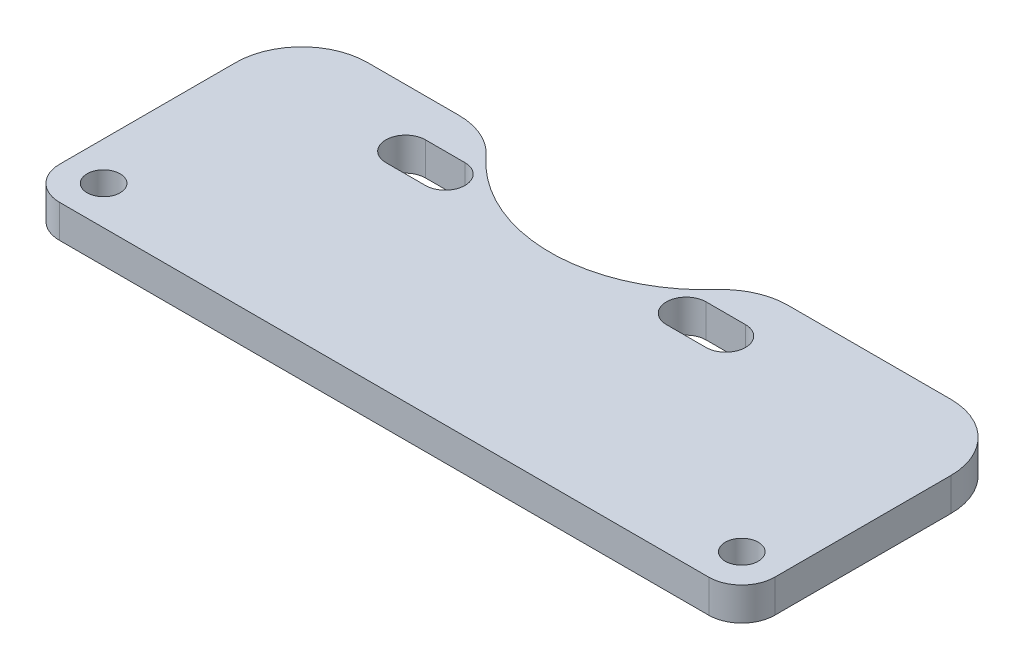
ISO-10303-21;
HEADER;
FILE_DESCRIPTION(('STEP AP214'),'2;1');
FILE_NAME('part.step','',(''),(''),'','','');
FILE_SCHEMA(('AUTOMOTIVE_DESIGN { 1 0 10303 214 1 1 1 1 }'));
ENDSEC;
DATA;
#1=APPLICATION_CONTEXT('core data for automotive mechanical design processes');
#2=APPLICATION_PROTOCOL_DEFINITION('international standard','automotive_design',2000,#1);
#3=PRODUCT_CONTEXT('',#1,'mechanical');
#4=PRODUCT('Part','Part','',(#3));
#5=PRODUCT_RELATED_PRODUCT_CATEGORY('part','',(#4));
#6=PRODUCT_DEFINITION_FORMATION('','',#4);
#7=PRODUCT_DEFINITION_CONTEXT('part definition',#1,'design');
#8=PRODUCT_DEFINITION('design','',#6,#7);
#9=PRODUCT_DEFINITION_SHAPE('','',#8);
#10=(LENGTH_UNIT() NAMED_UNIT(*) SI_UNIT(.MILLI.,.METRE.));
#11=(NAMED_UNIT(*) PLANE_ANGLE_UNIT() SI_UNIT($,.RADIAN.));
#12=(NAMED_UNIT(*) SI_UNIT($,.STERADIAN.) SOLID_ANGLE_UNIT());
#13=UNCERTAINTY_MEASURE_WITH_UNIT(LENGTH_MEASURE(1.E-05),#10,'distance_accuracy_value','');
#14=(GEOMETRIC_REPRESENTATION_CONTEXT(3) GLOBAL_UNCERTAINTY_ASSIGNED_CONTEXT((#13)) GLOBAL_UNIT_ASSIGNED_CONTEXT((#10,
#11,#12)) REPRESENTATION_CONTEXT('',''));
#15=CARTESIAN_POINT('',(0.,0.,0.));
#16=DIRECTION('',(0.,0.,1.));
#17=DIRECTION('',(1.,0.,0.));
#18=AXIS2_PLACEMENT_3D('',#15,#16,#17);
#19=CARTESIAN_POINT('',(-13.25,3.,-4.49999999999999));
#20=DIRECTION('',(0.,-1.,0.));
#21=DIRECTION('',(0.,0.,-1.));
#22=AXIS2_PLACEMENT_3D('',#19,#20,#21);
#23=CYLINDRICAL_SURFACE('',#22,14.15);
#24=CARTESIAN_POINT('',(-13.25,0.,-4.49999999999999));
#25=DIRECTION('',(0.,1.,0.));
#26=DIRECTION('',(0.,0.,1.));
#27=AXIS2_PLACEMENT_3D('',#24,#25,#26);
#28=CIRCLE('',#27,14.15);
#29=CARTESIAN_POINT('',(-23.7547264195242,0.,4.9801488833747));
#30=VERTEX_POINT('',#29);
#31=CARTESIAN_POINT('',(-2.7452735804758,0.,4.9801488833747));
#32=VERTEX_POINT('',#31);
#33=EDGE_CURVE('E260',#30,#32,#28,.T.);
#34=ORIENTED_EDGE('',*,*,#33,.F.);
#35=DIRECTION('',(0.,-1.,0.));
#36=VECTOR('',#35,1.);
#37=CARTESIAN_POINT('',(-23.7547264195242,3.,4.98014888337469));
#38=LINE('',#37,#36);
#39=CARTESIAN_POINT('',(-23.7547264195242,3.,4.9801488833747));
#40=VERTEX_POINT('',#39);
#41=EDGE_CURVE('E326',#30,#40,#38,.F.);
#42=ORIENTED_EDGE('',*,*,#41,.T.);
#43=CARTESIAN_POINT('',(-13.25,3.,-4.49999999999999));
#44=DIRECTION('',(0.,1.,0.));
#45=DIRECTION('',(0.,0.,1.));
#46=AXIS2_PLACEMENT_3D('',#43,#44,#45);
#47=CIRCLE('',#46,14.15);
#48=CARTESIAN_POINT('',(-2.7452735804758,3.,4.9801488833747));
#49=VERTEX_POINT('',#48);
#50=EDGE_CURVE('E219',#40,#49,#47,.T.);
#51=ORIENTED_EDGE('',*,*,#50,.T.);
#52=DIRECTION('',(0.,-1.,0.));
#53=VECTOR('',#52,1.);
#54=CARTESIAN_POINT('',(-2.7452735804758,3.,4.9801488833747));
#55=LINE('',#54,#53);
#56=EDGE_CURVE('E323',#49,#32,#55,.T.);
#57=ORIENTED_EDGE('',*,*,#56,.T.);
#58=EDGE_LOOP('',(#34,#42,#51,#57));
#59=FACE_BOUND('',#58,.T.);
#60=ADVANCED_FACE('F37',(#59),#23,.F.);
#61=CARTESIAN_POINT('',(0.,3.,3.00000000000001));
#62=DIRECTION('',(0.,0.,-1.));
#63=DIRECTION('',(-1.,0.,0.));
#64=AXIS2_PLACEMENT_3D('',#61,#62,#63);
#65=PLANE('',#64);
#66=DIRECTION('',(1.,0.,0.));
#67=VECTOR('',#66,1.);
#68=CARTESIAN_POINT('',(0.,3.,3.00000000000001));
#69=LINE('',#68,#67);
#70=CARTESIAN_POINT('',(-36.5,3.,3.00000000000001));
#71=VERTEX_POINT('',#70);
#72=CARTESIAN_POINT('',(-28.2090273747995,3.,3.00000000000001));
#73=VERTEX_POINT('',#72);
#74=EDGE_CURVE('E222',#71,#73,#69,.T.);
#75=ORIENTED_EDGE('',*,*,#74,.T.);
#76=DIRECTION('',(0.,-1.,0.));
#77=VECTOR('',#76,1.);
#78=CARTESIAN_POINT('',(-28.2090273747995,3.,3.00000000000001));
#79=LINE('',#78,#77);
#80=CARTESIAN_POINT('',(-28.2090273747995,0.,3.00000000000001));
#81=VERTEX_POINT('',#80);
#82=EDGE_CURVE('E312',#73,#81,#79,.T.);
#83=ORIENTED_EDGE('',*,*,#82,.T.);
#84=DIRECTION('',(1.,0.,0.));
#85=VECTOR('',#84,1.);
#86=CARTESIAN_POINT('',(0.,0.,3.00000000000001));
#87=LINE('',#86,#85);
#88=CARTESIAN_POINT('',(-36.5,0.,3.00000000000001));
#89=VERTEX_POINT('',#88);
#90=EDGE_CURVE('E263',#89,#81,#87,.T.);
#91=ORIENTED_EDGE('',*,*,#90,.F.);
#92=DIRECTION('',(0.,-1.,0.));
#93=VECTOR('',#92,1.);
#94=CARTESIAN_POINT('',(-36.5,3.,3.00000000000001));
#95=LINE('',#94,#93);
#96=EDGE_CURVE('E310',#89,#71,#95,.F.);
#97=ORIENTED_EDGE('',*,*,#96,.T.);
#98=EDGE_LOOP('',(#75,#83,#91,#97));
#99=FACE_BOUND('',#98,.T.);
#100=ADVANCED_FACE('F372',(#99),#65,.T.);
#101=CARTESIAN_POINT('',(-42.5,3.,0.));
#102=DIRECTION('',(-1.,0.,0.));
#103=DIRECTION('',(0.,0.,1.));
#104=AXIS2_PLACEMENT_3D('',#101,#102,#103);
#105=PLANE('',#104);
#106=DIRECTION('',(0.,0.,-1.));
#107=VECTOR('',#106,1.);
#108=CARTESIAN_POINT('',(-42.5,3.,0.));
#109=LINE('',#108,#107);
#110=CARTESIAN_POINT('',(-42.5,3.,25.));
#111=VERTEX_POINT('',#110);
#112=CARTESIAN_POINT('',(-42.5,3.,9.00000000000001));
#113=VERTEX_POINT('',#112);
#114=EDGE_CURVE('E227',#111,#113,#109,.T.);
#115=ORIENTED_EDGE('',*,*,#114,.T.);
#116=DIRECTION('',(0.,-1.,0.));
#117=VECTOR('',#116,1.);
#118=CARTESIAN_POINT('',(-42.5,3.,9.00000000000001));
#119=LINE('',#118,#117);
#120=CARTESIAN_POINT('',(-42.5,0.,9.00000000000001));
#121=VERTEX_POINT('',#120);
#122=EDGE_CURVE('E11',#113,#121,#119,.T.);
#123=ORIENTED_EDGE('',*,*,#122,.T.);
#124=DIRECTION('',(0.,0.,-1.));
#125=VECTOR('',#124,1.);
#126=CARTESIAN_POINT('',(-42.5,0.,0.));
#127=LINE('',#126,#125);
#128=CARTESIAN_POINT('',(-42.5,0.,25.));
#129=VERTEX_POINT('',#128);
#130=EDGE_CURVE('E269',#129,#121,#127,.T.);
#131=ORIENTED_EDGE('',*,*,#130,.F.);
#132=DIRECTION('',(0.,-1.,0.));
#133=VECTOR('',#132,1.);
#134=CARTESIAN_POINT('',(-42.5,3.,25.));
#135=LINE('',#134,#133);
#136=EDGE_CURVE('E308',#129,#111,#135,.F.);
#137=ORIENTED_EDGE('',*,*,#136,.T.);
#138=EDGE_LOOP('',(#115,#123,#131,#137));
#139=FACE_BOUND('',#138,.T.);
#140=ADVANCED_FACE('F378',(#139),#105,.T.);
#141=CARTESIAN_POINT('',(0.,3.,28.));
#142=DIRECTION('',(0.,0.,-1.));
#143=DIRECTION('',(-1.,0.,0.));
#144=AXIS2_PLACEMENT_3D('',#141,#142,#143);
#145=PLANE('',#144);
#146=DIRECTION('',(1.,0.,0.));
#147=VECTOR('',#146,1.);
#148=CARTESIAN_POINT('',(0.,0.,28.));
#149=LINE('',#148,#147);
#150=CARTESIAN_POINT('',(-39.5,0.,28.));
#151=VERTEX_POINT('',#150);
#152=CARTESIAN_POINT('',(19.5,0.,28.));
#153=VERTEX_POINT('',#152);
#154=EDGE_CURVE('E272',#151,#153,#149,.T.);
#155=ORIENTED_EDGE('',*,*,#154,.T.);
#156=DIRECTION('',(0.,-1.,0.));
#157=VECTOR('',#156,1.);
#158=CARTESIAN_POINT('',(19.5,3.,28.));
#159=LINE('',#158,#157);
#160=CARTESIAN_POINT('',(19.5,3.,28.));
#161=VERTEX_POINT('',#160);
#162=EDGE_CURVE('E302',#153,#161,#159,.F.);
#163=ORIENTED_EDGE('',*,*,#162,.T.);
#164=DIRECTION('',(1.,0.,0.));
#165=VECTOR('',#164,1.);
#166=CARTESIAN_POINT('',(0.,3.,28.));
#167=LINE('',#166,#165);
#168=CARTESIAN_POINT('',(-39.5,3.,28.));
#169=VERTEX_POINT('',#168);
#170=EDGE_CURVE('E229',#169,#161,#167,.T.);
#171=ORIENTED_EDGE('',*,*,#170,.F.);
#172=DIRECTION('',(0.,-1.,0.));
#173=VECTOR('',#172,1.);
#174=CARTESIAN_POINT('',(-39.5,0.,28.));
#175=LINE('',#174,#173);
#176=EDGE_CURVE('E299',#169,#151,#175,.T.);
#177=ORIENTED_EDGE('',*,*,#176,.T.);
#178=EDGE_LOOP('',(#155,#163,#171,#177));
#179=FACE_BOUND('',#178,.T.);
#180=ADVANCED_FACE('F387',(#179),#145,.F.);
#181=CARTESIAN_POINT('',(22.5,3.,0.));
#182=DIRECTION('',(-1.,0.,0.));
#183=DIRECTION('',(0.,0.,1.));
#184=AXIS2_PLACEMENT_3D('',#181,#182,#183);
#185=PLANE('',#184);
#186=DIRECTION('',(0.,0.,-1.));
#187=VECTOR('',#186,1.);
#188=CARTESIAN_POINT('',(22.5,0.,0.));
#189=LINE('',#188,#187);
#190=CARTESIAN_POINT('',(22.5,0.,25.));
#191=VERTEX_POINT('',#190);
#192=CARTESIAN_POINT('',(22.5,0.,9.00000000000001));
#193=VERTEX_POINT('',#192);
#194=EDGE_CURVE('E268',#191,#193,#189,.T.);
#195=ORIENTED_EDGE('',*,*,#194,.T.);
#196=DIRECTION('',(0.,-1.,0.));
#197=VECTOR('',#196,1.);
#198=CARTESIAN_POINT('',(22.5,3.,9.00000000000001));
#199=LINE('',#198,#197);
#200=CARTESIAN_POINT('',(22.5,3.,9.00000000000001));
#201=VERTEX_POINT('',#200);
#202=EDGE_CURVE('E45',#193,#201,#199,.F.);
#203=ORIENTED_EDGE('',*,*,#202,.T.);
#204=DIRECTION('',(0.,0.,-1.));
#205=VECTOR('',#204,1.);
#206=CARTESIAN_POINT('',(22.5,3.,0.));
#207=LINE('',#206,#205);
#208=CARTESIAN_POINT('',(22.5,3.,25.));
#209=VERTEX_POINT('',#208);
#210=EDGE_CURVE('E226',#209,#201,#207,.T.);
#211=ORIENTED_EDGE('',*,*,#210,.F.);
#212=DIRECTION('',(0.,-1.,0.));
#213=VECTOR('',#212,1.);
#214=CARTESIAN_POINT('',(22.5,3.,25.));
#215=LINE('',#214,#213);
#216=EDGE_CURVE('E288',#209,#191,#215,.T.);
#217=ORIENTED_EDGE('',*,*,#216,.T.);
#218=EDGE_LOOP('',(#195,#203,#211,#217));
#219=FACE_BOUND('',#218,.T.);
#220=ADVANCED_FACE('F341',(#219),#185,.F.);
#221=CARTESIAN_POINT('',(-27.7972698780689,3.,8.25000000000001));
#222=DIRECTION('',(0.,-1.,0.));
#223=DIRECTION('',(0.,0.,-1.));
#224=AXIS2_PLACEMENT_3D('',#221,#222,#223);
#225=CYLINDRICAL_SURFACE('',#224,1.79726987806885);
#226=CARTESIAN_POINT('',(-27.7972698780689,0.,8.25000000000001));
#227=DIRECTION('',(0.,1.,0.));
#228=DIRECTION('',(0.,0.,1.));
#229=AXIS2_PLACEMENT_3D('',#226,#227,#228);
#230=CIRCLE('',#229,1.79726987806885);
#231=CARTESIAN_POINT('',(-27.7972698780689,0.,6.45273012193115));
#232=VERTEX_POINT('',#231);
#233=CARTESIAN_POINT('',(-27.7972698780689,0.,10.0472698780689));
#234=VERTEX_POINT('',#233);
#235=EDGE_CURVE('E248',#232,#234,#230,.T.);
#236=ORIENTED_EDGE('',*,*,#235,.F.);
#237=DIRECTION('',(0.,-1.,0.));
#238=VECTOR('',#237,1.);
#239=CARTESIAN_POINT('',(-27.7972698780689,3.,6.45273012193115));
#240=LINE('',#239,#238);
#241=CARTESIAN_POINT('',(-27.7972698780689,3.,6.45273012193115));
#242=VERTEX_POINT('',#241);
#243=EDGE_CURVE('E286',#242,#232,#240,.T.);
#244=ORIENTED_EDGE('',*,*,#243,.F.);
#245=CARTESIAN_POINT('',(-27.7972698780689,3.,8.25000000000001));
#246=DIRECTION('',(0.,1.,0.));
#247=DIRECTION('',(0.,0.,1.));
#248=AXIS2_PLACEMENT_3D('',#245,#246,#247);
#249=CIRCLE('',#248,1.79726987806885);
#250=CARTESIAN_POINT('',(-27.7972698780689,3.,10.0472698780689));
#251=VERTEX_POINT('',#250);
#252=EDGE_CURVE('E208',#242,#251,#249,.T.);
#253=ORIENTED_EDGE('',*,*,#252,.T.);
#254=DIRECTION('',(0.,-1.,0.));
#255=VECTOR('',#254,1.);
#256=CARTESIAN_POINT('',(-27.7972698780689,3.,10.0472698780689));
#257=LINE('',#256,#255);
#258=EDGE_CURVE('E187',#251,#234,#257,.T.);
#259=ORIENTED_EDGE('',*,*,#258,.T.);
#260=EDGE_LOOP('',(#236,#244,#253,#259));
#261=FACE_BOUND('',#260,.T.);
#262=ADVANCED_FACE('F422',(#261),#225,.F.);
#263=CARTESIAN_POINT('',(0.,3.,6.45273012193115));
#264=DIRECTION('',(0.,0.,1.));
#265=DIRECTION('',(1.,0.,0.));
#266=AXIS2_PLACEMENT_3D('',#263,#264,#265);
#267=PLANE('',#266);
#268=DIRECTION('',(-1.,0.,0.));
#269=VECTOR('',#268,1.);
#270=CARTESIAN_POINT('',(0.,0.,6.45273012193115));
#271=LINE('',#270,#269);
#272=CARTESIAN_POINT('',(-24.2027301219311,0.,6.45273012193115));
#273=VERTEX_POINT('',#272);
#274=EDGE_CURVE('E251',#273,#232,#271,.T.);
#275=ORIENTED_EDGE('',*,*,#274,.F.);
#276=DIRECTION('',(0.,-1.,0.));
#277=VECTOR('',#276,1.);
#278=CARTESIAN_POINT('',(-24.2027301219311,3.,6.45273012193115));
#279=LINE('',#278,#277);
#280=CARTESIAN_POINT('',(-24.2027301219311,3.,6.45273012193115));
#281=VERTEX_POINT('',#280);
#282=EDGE_CURVE('E284',#281,#273,#279,.T.);
#283=ORIENTED_EDGE('',*,*,#282,.F.);
#284=DIRECTION('',(-1.,0.,0.));
#285=VECTOR('',#284,1.);
#286=CARTESIAN_POINT('',(0.,3.,6.45273012193115));
#287=LINE('',#286,#285);
#288=EDGE_CURVE('E211',#281,#242,#287,.T.);
#289=ORIENTED_EDGE('',*,*,#288,.T.);
#290=ORIENTED_EDGE('',*,*,#243,.T.);
#291=EDGE_LOOP('',(#275,#283,#289,#290));
#292=FACE_BOUND('',#291,.T.);
#293=ADVANCED_FACE('F418',(#292),#267,.T.);
#294=CARTESIAN_POINT('',(-24.2027301219311,3.,8.25000000000001));
#295=DIRECTION('',(0.,-1.,0.));
#296=DIRECTION('',(0.,0.,-1.));
#297=AXIS2_PLACEMENT_3D('',#294,#295,#296);
#298=CYLINDRICAL_SURFACE('',#297,1.79726987806885);
#299=CARTESIAN_POINT('',(-24.2027301219311,0.,8.25000000000001));
#300=DIRECTION('',(0.,1.,0.));
#301=DIRECTION('',(0.,0.,1.));
#302=AXIS2_PLACEMENT_3D('',#299,#300,#301);
#303=CIRCLE('',#302,1.79726987806885);
#304=CARTESIAN_POINT('',(-24.2027301219311,0.,10.0472698780689));
#305=VERTEX_POINT('',#304);
#306=EDGE_CURVE('E254',#305,#273,#303,.T.);
#307=ORIENTED_EDGE('',*,*,#306,.F.);
#308=DIRECTION('',(0.,-1.,0.));
#309=VECTOR('',#308,1.);
#310=CARTESIAN_POINT('',(-24.2027301219311,3.,10.0472698780689));
#311=LINE('',#310,#309);
#312=CARTESIAN_POINT('',(-24.2027301219311,3.,10.0472698780689));
#313=VERTEX_POINT('',#312);
#314=EDGE_CURVE('E282',#313,#305,#311,.T.);
#315=ORIENTED_EDGE('',*,*,#314,.F.);
#316=CARTESIAN_POINT('',(-24.2027301219311,3.,8.25000000000001));
#317=DIRECTION('',(0.,1.,0.));
#318=DIRECTION('',(0.,0.,1.));
#319=AXIS2_PLACEMENT_3D('',#316,#317,#318);
#320=CIRCLE('',#319,1.79726987806885);
#321=EDGE_CURVE('E214',#313,#281,#320,.T.);
#322=ORIENTED_EDGE('',*,*,#321,.T.);
#323=ORIENTED_EDGE('',*,*,#282,.T.);
#324=EDGE_LOOP('',(#307,#315,#322,#323));
#325=FACE_BOUND('',#324,.T.);
#326=ADVANCED_FACE('F415',(#325),#298,.F.);
#327=CARTESIAN_POINT('',(1.29726987806886,3.,8.25000000000001));
#328=DIRECTION('',(0.,-1.,0.));
#329=DIRECTION('',(0.,0.,-1.));
#330=AXIS2_PLACEMENT_3D('',#327,#328,#329);
#331=CYLINDRICAL_SURFACE('',#330,1.79726987806885);
#332=CARTESIAN_POINT('',(1.29726987806886,0.,8.25000000000001));
#333=DIRECTION('',(0.,1.,0.));
#334=DIRECTION('',(0.,0.,1.));
#335=AXIS2_PLACEMENT_3D('',#332,#333,#334);
#336=CIRCLE('',#335,1.79726987806885);
#337=CARTESIAN_POINT('',(1.29726987806886,0.,10.0472698780689));
#338=VERTEX_POINT('',#337);
#339=CARTESIAN_POINT('',(1.29726987806886,0.,6.45273012193115));
#340=VERTEX_POINT('',#339);
#341=EDGE_CURVE('E182',#338,#340,#336,.T.);
#342=ORIENTED_EDGE('',*,*,#341,.F.);
#343=DIRECTION('',(0.,-1.,0.));
#344=VECTOR('',#343,1.);
#345=CARTESIAN_POINT('',(1.29726987806886,3.,10.0472698780689));
#346=LINE('',#345,#344);
#347=CARTESIAN_POINT('',(1.29726987806886,3.,10.0472698780689));
#348=VERTEX_POINT('',#347);
#349=EDGE_CURVE('E177',#348,#338,#346,.T.);
#350=ORIENTED_EDGE('',*,*,#349,.F.);
#351=CARTESIAN_POINT('',(1.29726987806886,3.,8.25000000000001));
#352=DIRECTION('',(0.,1.,0.));
#353=DIRECTION('',(0.,0.,1.));
#354=AXIS2_PLACEMENT_3D('',#351,#352,#353);
#355=CIRCLE('',#354,1.79726987806885);
#356=CARTESIAN_POINT('',(1.29726987806886,3.,6.45273012193115));
#357=VERTEX_POINT('',#356);
#358=EDGE_CURVE('E180',#348,#357,#355,.T.);
#359=ORIENTED_EDGE('',*,*,#358,.T.);
#360=DIRECTION('',(0.,-1.,0.));
#361=VECTOR('',#360,1.);
#362=CARTESIAN_POINT('',(1.29726987806886,3.,6.45273012193115));
#363=LINE('',#362,#361);
#364=EDGE_CURVE('E238',#357,#340,#363,.T.);
#365=ORIENTED_EDGE('',*,*,#364,.T.);
#366=EDGE_LOOP('',(#342,#350,#359,#365));
#367=FACE_BOUND('',#366,.T.);
#368=ADVANCED_FACE('F179',(#367),#331,.F.);
#369=CARTESIAN_POINT('',(0.,3.,10.0472698780689));
#370=DIRECTION('',(0.,0.,-1.));
#371=DIRECTION('',(-1.,0.,0.));
#372=AXIS2_PLACEMENT_3D('',#369,#370,#371);
#373=PLANE('',#372);
#374=DIRECTION('',(1.,0.,0.));
#375=VECTOR('',#374,1.);
#376=CARTESIAN_POINT('',(0.,0.,10.0472698780689));
#377=LINE('',#376,#375);
#378=CARTESIAN_POINT('',(-2.29726987806885,0.,10.0472698780689));
#379=VERTEX_POINT('',#378);
#380=EDGE_CURVE('E240',#379,#338,#377,.T.);
#381=ORIENTED_EDGE('',*,*,#380,.F.);
#382=DIRECTION('',(0.,-1.,0.));
#383=VECTOR('',#382,1.);
#384=CARTESIAN_POINT('',(-2.29726987806885,3.,10.0472698780689));
#385=LINE('',#384,#383);
#386=CARTESIAN_POINT('',(-2.29726987806885,3.,10.0472698780689));
#387=VERTEX_POINT('',#386);
#388=EDGE_CURVE('E188',#387,#379,#385,.T.);
#389=ORIENTED_EDGE('',*,*,#388,.F.);
#390=DIRECTION('',(1.,0.,0.));
#391=VECTOR('',#390,1.);
#392=CARTESIAN_POINT('',(0.,3.,10.0472698780689));
#393=LINE('',#392,#391);
#394=EDGE_CURVE('E195',#387,#348,#393,.T.);
#395=ORIENTED_EDGE('',*,*,#394,.T.);
#396=ORIENTED_EDGE('',*,*,#349,.T.);
#397=EDGE_LOOP('',(#381,#389,#395,#396));
#398=FACE_BOUND('',#397,.T.);
#399=ADVANCED_FACE('F202',(#398),#373,.T.);
#400=CARTESIAN_POINT('',(-2.29726987806885,3.,8.25000000000001));
#401=DIRECTION('',(0.,-1.,0.));
#402=DIRECTION('',(0.,0.,-1.));
#403=AXIS2_PLACEMENT_3D('',#400,#401,#402);
#404=CYLINDRICAL_SURFACE('',#403,1.79726987806885);
#405=CARTESIAN_POINT('',(-2.29726987806885,0.,8.25000000000001));
#406=DIRECTION('',(0.,1.,0.));
#407=DIRECTION('',(0.,0.,1.));
#408=AXIS2_PLACEMENT_3D('',#405,#406,#407);
#409=CIRCLE('',#408,1.79726987806885);
#410=CARTESIAN_POINT('',(-2.29726987806885,0.,6.45273012193115));
#411=VERTEX_POINT('',#410);
#412=EDGE_CURVE('E242',#411,#379,#409,.T.);
#413=ORIENTED_EDGE('',*,*,#412,.F.);
#414=DIRECTION('',(0.,-1.,0.));
#415=VECTOR('',#414,1.);
#416=CARTESIAN_POINT('',(-2.29726987806885,3.,6.45273012193115));
#417=LINE('',#416,#415);
#418=CARTESIAN_POINT('',(-2.29726987806885,3.,6.45273012193115));
#419=VERTEX_POINT('',#418);
#420=EDGE_CURVE('E290',#419,#411,#417,.T.);
#421=ORIENTED_EDGE('',*,*,#420,.F.);
#422=CARTESIAN_POINT('',(-2.29726987806885,3.,8.25000000000001));
#423=DIRECTION('',(0.,1.,0.));
#424=DIRECTION('',(0.,0.,1.));
#425=AXIS2_PLACEMENT_3D('',#422,#423,#424);
#426=CIRCLE('',#425,1.79726987806885);
#427=EDGE_CURVE('E203',#419,#387,#426,.T.);
#428=ORIENTED_EDGE('',*,*,#427,.T.);
#429=ORIENTED_EDGE('',*,*,#388,.T.);
#430=EDGE_LOOP('',(#413,#421,#428,#429));
#431=FACE_BOUND('',#430,.T.);
#432=ADVANCED_FACE('F431',(#431),#404,.F.);
#433=CARTESIAN_POINT('',(19.,3.,24.5));
#434=DIRECTION('',(0.,-1.,0.));
#435=DIRECTION('',(0.,0.,-1.));
#436=AXIS2_PLACEMENT_3D('',#433,#434,#435);
#437=CYLINDRICAL_SURFACE('',#436,1.5);
#438=CARTESIAN_POINT('',(19.,3.,24.5));
#439=DIRECTION('',(0.,1.,0.));
#440=DIRECTION('',(0.,0.,1.));
#441=AXIS2_PLACEMENT_3D('',#438,#439,#440);
#442=CIRCLE('',#441,1.5);
#443=CARTESIAN_POINT('',(19.,3.,26.));
#444=VERTEX_POINT('',#443);
#445=EDGE_CURVE('E225',#444,#444,#442,.T.);
#446=ORIENTED_EDGE('',*,*,#445,.T.);
#447=EDGE_LOOP('',(#446));
#448=FACE_BOUND('',#447,.T.);
#449=CARTESIAN_POINT('',(19.,0.,24.5));
#450=DIRECTION('',(0.,1.,0.));
#451=DIRECTION('',(0.,0.,1.));
#452=AXIS2_PLACEMENT_3D('',#449,#450,#451);
#453=CIRCLE('',#452,1.5);
#454=CARTESIAN_POINT('',(19.,0.,26.));
#455=VERTEX_POINT('',#454);
#456=EDGE_CURVE('E267',#455,#455,#453,.T.);
#457=ORIENTED_EDGE('',*,*,#456,.F.);
#458=EDGE_LOOP('',(#457));
#459=FACE_BOUND('',#458,.T.);
#460=ADVANCED_FACE('F434',(#448,#459),#437,.F.);
#461=CARTESIAN_POINT('',(1.70902737479948,0.,3.00000000000001));
#462=VERTEX_POINT('',#461);
#463=CARTESIAN_POINT('',(16.5,0.,3.00000000000001));
#464=VERTEX_POINT('',#463);
#465=EDGE_CURVE('E264',#462,#464,#87,.T.);
#466=ORIENTED_EDGE('',*,*,#465,.F.);
#467=DIRECTION('',(0.,-1.,0.));
#468=VECTOR('',#467,1.);
#469=CARTESIAN_POINT('',(1.70902737479948,3.,3.00000000000001));
#470=LINE('',#469,#468);
#471=CARTESIAN_POINT('',(1.70902737479948,3.,3.00000000000001));
#472=VERTEX_POINT('',#471);
#473=EDGE_CURVE('E337',#462,#472,#470,.F.);
#474=ORIENTED_EDGE('',*,*,#473,.T.);
#475=CARTESIAN_POINT('',(16.5,3.,3.00000000000001));
#476=VERTEX_POINT('',#475);
#477=EDGE_CURVE('E223',#472,#476,#69,.T.);
#478=ORIENTED_EDGE('',*,*,#477,.T.);
#479=DIRECTION('',(0.,-1.,0.));
#480=VECTOR('',#479,1.);
#481=CARTESIAN_POINT('',(16.5,0.,3.00000000000001));
#482=LINE('',#481,#480);
#483=EDGE_CURVE('E334',#476,#464,#482,.T.);
#484=ORIENTED_EDGE('',*,*,#483,.T.);
#485=EDGE_LOOP('',(#466,#474,#478,#484));
#486=FACE_BOUND('',#485,.T.);
#487=ADVANCED_FACE('F352',(#486),#65,.T.);
#488=CARTESIAN_POINT('',(0.,3.,10.0472698780689));
#489=DIRECTION('',(0.,0.,1.));
#490=DIRECTION('',(1.,0.,0.));
#491=AXIS2_PLACEMENT_3D('',#488,#489,#490);
#492=PLANE('',#491);
#493=DIRECTION('',(-1.,0.,0.));
#494=VECTOR('',#493,1.);
#495=CARTESIAN_POINT('',(0.,0.,10.0472698780689));
#496=LINE('',#495,#494);
#497=EDGE_CURVE('E257',#305,#234,#496,.T.);
#498=ORIENTED_EDGE('',*,*,#497,.T.);
#499=ORIENTED_EDGE('',*,*,#258,.F.);
#500=DIRECTION('',(-1.,0.,0.));
#501=VECTOR('',#500,1.);
#502=CARTESIAN_POINT('',(0.,3.,10.0472698780689));
#503=LINE('',#502,#501);
#504=EDGE_CURVE('E217',#313,#251,#503,.T.);
#505=ORIENTED_EDGE('',*,*,#504,.F.);
#506=ORIENTED_EDGE('',*,*,#314,.T.);
#507=EDGE_LOOP('',(#498,#499,#505,#506));
#508=FACE_BOUND('',#507,.T.);
#509=ADVANCED_FACE('F410',(#508),#492,.F.);
#510=CARTESIAN_POINT('',(0.,3.,6.45273012193115));
#511=DIRECTION('',(0.,0.,-1.));
#512=DIRECTION('',(-1.,0.,0.));
#513=AXIS2_PLACEMENT_3D('',#510,#511,#512);
#514=PLANE('',#513);
#515=DIRECTION('',(1.,0.,0.));
#516=VECTOR('',#515,1.);
#517=CARTESIAN_POINT('',(0.,0.,6.45273012193115));
#518=LINE('',#517,#516);
#519=EDGE_CURVE('E245',#411,#340,#518,.T.);
#520=ORIENTED_EDGE('',*,*,#519,.T.);
#521=ORIENTED_EDGE('',*,*,#364,.F.);
#522=DIRECTION('',(1.,0.,0.));
#523=VECTOR('',#522,1.);
#524=CARTESIAN_POINT('',(0.,3.,6.45273012193115));
#525=LINE('',#524,#523);
#526=EDGE_CURVE('E198',#419,#357,#525,.T.);
#527=ORIENTED_EDGE('',*,*,#526,.F.);
#528=ORIENTED_EDGE('',*,*,#420,.T.);
#529=EDGE_LOOP('',(#520,#521,#527,#528));
#530=FACE_BOUND('',#529,.T.);
#531=ADVANCED_FACE('F413',(#530),#514,.F.);
#532=CARTESIAN_POINT('',(-39.,3.,24.5));
#533=DIRECTION('',(0.,-1.,0.));
#534=DIRECTION('',(0.,0.,-1.));
#535=AXIS2_PLACEMENT_3D('',#532,#533,#534);
#536=CYLINDRICAL_SURFACE('',#535,1.5);
#537=CARTESIAN_POINT('',(-39.,3.,24.5));
#538=DIRECTION('',(0.,1.,0.));
#539=DIRECTION('',(0.,0.,1.));
#540=AXIS2_PLACEMENT_3D('',#537,#538,#539);
#541=CIRCLE('',#540,1.5);
#542=CARTESIAN_POINT('',(-39.,3.,26.));
#543=VERTEX_POINT('',#542);
#544=EDGE_CURVE('E235',#543,#543,#541,.T.);
#545=ORIENTED_EDGE('',*,*,#544,.T.);
#546=EDGE_LOOP('',(#545));
#547=FACE_BOUND('',#546,.T.);
#548=CARTESIAN_POINT('',(-39.,0.,24.5));
#549=DIRECTION('',(0.,1.,0.));
#550=DIRECTION('',(0.,0.,1.));
#551=AXIS2_PLACEMENT_3D('',#548,#549,#550);
#552=CIRCLE('',#551,1.5);
#553=CARTESIAN_POINT('',(-39.,0.,26.));
#554=VERTEX_POINT('',#553);
#555=EDGE_CURVE('E200',#554,#554,#552,.T.);
#556=ORIENTED_EDGE('',*,*,#555,.F.);
#557=EDGE_LOOP('',(#556));
#558=FACE_BOUND('',#557,.T.);
#559=ADVANCED_FACE('F429',(#547,#558),#536,.F.);
#560=CARTESIAN_POINT('',(0.,3.,0.));
#561=DIRECTION('',(0.,1.,0.));
#562=DIRECTION('',(0.,0.,1.));
#563=AXIS2_PLACEMENT_3D('',#560,#561,#562);
#564=PLANE('',#563);
#565=ORIENTED_EDGE('',*,*,#358,.F.);
#566=ORIENTED_EDGE('',*,*,#394,.F.);
#567=ORIENTED_EDGE('',*,*,#427,.F.);
#568=ORIENTED_EDGE('',*,*,#526,.T.);
#569=EDGE_LOOP('',(#565,#566,#567,#568));
#570=FACE_BOUND('',#569,.T.);
#571=ORIENTED_EDGE('',*,*,#252,.F.);
#572=ORIENTED_EDGE('',*,*,#288,.F.);
#573=ORIENTED_EDGE('',*,*,#321,.F.);
#574=ORIENTED_EDGE('',*,*,#504,.T.);
#575=EDGE_LOOP('',(#571,#572,#573,#574));
#576=FACE_BOUND('',#575,.T.);
#577=ORIENTED_EDGE('',*,*,#50,.F.);
#578=CARTESIAN_POINT('',(-28.2090273747995,3.,9.00000000000001));
#579=DIRECTION('',(0.,1.,0.));
#580=DIRECTION('',(0.,0.,1.));
#581=AXIS2_PLACEMENT_3D('',#578,#579,#580);
#582=CIRCLE('',#581,6.);
#583=EDGE_CURVE('E332',#40,#73,#582,.T.);
#584=ORIENTED_EDGE('',*,*,#583,.T.);
#585=ORIENTED_EDGE('',*,*,#74,.F.);
#586=CARTESIAN_POINT('',(-36.5,3.,9.00000000000001));
#587=DIRECTION('',(0.,1.,0.));
#588=DIRECTION('',(0.,0.,1.));
#589=AXIS2_PLACEMENT_3D('',#586,#587,#588);
#590=CIRCLE('',#589,6.);
#591=EDGE_CURVE('E52',#71,#113,#590,.T.);
#592=ORIENTED_EDGE('',*,*,#591,.T.);
#593=ORIENTED_EDGE('',*,*,#114,.F.);
#594=CARTESIAN_POINT('',(-39.5,3.,25.));
#595=DIRECTION('',(0.,1.,0.));
#596=DIRECTION('',(0.,0.,1.));
#597=AXIS2_PLACEMENT_3D('',#594,#595,#596);
#598=CIRCLE('',#597,3.);
#599=EDGE_CURVE('E304',#111,#169,#598,.T.);
#600=ORIENTED_EDGE('',*,*,#599,.T.);
#601=ORIENTED_EDGE('',*,*,#170,.T.);
#602=CARTESIAN_POINT('',(19.5,3.,25.));
#603=DIRECTION('',(0.,1.,0.));
#604=DIRECTION('',(0.,0.,1.));
#605=AXIS2_PLACEMENT_3D('',#602,#603,#604);
#606=CIRCLE('',#605,3.);
#607=EDGE_CURVE('E306',#161,#209,#606,.T.);
#608=ORIENTED_EDGE('',*,*,#607,.T.);
#609=ORIENTED_EDGE('',*,*,#210,.T.);
#610=CARTESIAN_POINT('',(16.5,3.,9.00000000000001));
#611=DIRECTION('',(0.,1.,0.));
#612=DIRECTION('',(0.,0.,1.));
#613=AXIS2_PLACEMENT_3D('',#610,#611,#612);
#614=CIRCLE('',#613,6.);
#615=EDGE_CURVE('E59',#201,#476,#614,.T.);
#616=ORIENTED_EDGE('',*,*,#615,.T.);
#617=ORIENTED_EDGE('',*,*,#477,.F.);
#618=CARTESIAN_POINT('',(1.70902737479948,3.,9.00000000000001));
#619=DIRECTION('',(0.,1.,0.));
#620=DIRECTION('',(0.,0.,1.));
#621=AXIS2_PLACEMENT_3D('',#618,#619,#620);
#622=CIRCLE('',#621,6.);
#623=EDGE_CURVE('E330',#472,#49,#622,.T.);
#624=ORIENTED_EDGE('',*,*,#623,.T.);
#625=EDGE_LOOP('',(#577,#584,#585,#592,#593,#600,#601,#608,#609,#616,#617,#624));
#626=FACE_BOUND('',#625,.T.);
#627=ORIENTED_EDGE('',*,*,#445,.F.);
#628=EDGE_LOOP('',(#627));
#629=FACE_BOUND('',#628,.T.);
#630=ORIENTED_EDGE('',*,*,#544,.F.);
#631=EDGE_LOOP('',(#630));
#632=FACE_BOUND('',#631,.T.);
#633=ADVANCED_FACE('F192',(#570,#576,#626,#629,#632),#564,.T.);
#634=CARTESIAN_POINT('',(0.,0.,0.));
#635=DIRECTION('',(0.,1.,0.));
#636=DIRECTION('',(0.,0.,1.));
#637=AXIS2_PLACEMENT_3D('',#634,#635,#636);
#638=PLANE('',#637);
#639=ORIENTED_EDGE('',*,*,#341,.T.);
#640=ORIENTED_EDGE('',*,*,#519,.F.);
#641=ORIENTED_EDGE('',*,*,#412,.T.);
#642=ORIENTED_EDGE('',*,*,#380,.T.);
#643=EDGE_LOOP('',(#639,#640,#641,#642));
#644=FACE_BOUND('',#643,.T.);
#645=ORIENTED_EDGE('',*,*,#235,.T.);
#646=ORIENTED_EDGE('',*,*,#497,.F.);
#647=ORIENTED_EDGE('',*,*,#306,.T.);
#648=ORIENTED_EDGE('',*,*,#274,.T.);
#649=EDGE_LOOP('',(#645,#646,#647,#648));
#650=FACE_BOUND('',#649,.T.);
#651=ORIENTED_EDGE('',*,*,#90,.T.);
#652=CARTESIAN_POINT('',(-28.2090273747995,0.,9.00000000000001));
#653=DIRECTION('',(0.,1.,0.));
#654=DIRECTION('',(0.,0.,1.));
#655=AXIS2_PLACEMENT_3D('',#652,#653,#654);
#656=CIRCLE('',#655,6.);
#657=EDGE_CURVE('E321',#81,#30,#656,.F.);
#658=ORIENTED_EDGE('',*,*,#657,.T.);
#659=ORIENTED_EDGE('',*,*,#33,.T.);
#660=CARTESIAN_POINT('',(1.70902737479948,0.,9.00000000000001));
#661=DIRECTION('',(0.,1.,0.));
#662=DIRECTION('',(0.,0.,1.));
#663=AXIS2_PLACEMENT_3D('',#660,#661,#662);
#664=CIRCLE('',#663,6.);
#665=EDGE_CURVE('E319',#32,#462,#664,.F.);
#666=ORIENTED_EDGE('',*,*,#665,.T.);
#667=ORIENTED_EDGE('',*,*,#465,.T.);
#668=CARTESIAN_POINT('',(16.5,0.,9.00000000000001));
#669=DIRECTION('',(0.,1.,0.));
#670=DIRECTION('',(0.,0.,1.));
#671=AXIS2_PLACEMENT_3D('',#668,#669,#670);
#672=CIRCLE('',#671,6.);
#673=EDGE_CURVE('E317',#464,#193,#672,.F.);
#674=ORIENTED_EDGE('',*,*,#673,.T.);
#675=ORIENTED_EDGE('',*,*,#194,.F.);
#676=CARTESIAN_POINT('',(19.5,0.,25.));
#677=DIRECTION('',(0.,1.,0.));
#678=DIRECTION('',(0.,0.,1.));
#679=AXIS2_PLACEMENT_3D('',#676,#677,#678);
#680=CIRCLE('',#679,3.);
#681=EDGE_CURVE('E297',#191,#153,#680,.F.);
#682=ORIENTED_EDGE('',*,*,#681,.T.);
#683=ORIENTED_EDGE('',*,*,#154,.F.);
#684=CARTESIAN_POINT('',(-39.5,0.,25.));
#685=DIRECTION('',(0.,1.,0.));
#686=DIRECTION('',(0.,0.,1.));
#687=AXIS2_PLACEMENT_3D('',#684,#685,#686);
#688=CIRCLE('',#687,3.);
#689=EDGE_CURVE('E295',#151,#129,#688,.F.);
#690=ORIENTED_EDGE('',*,*,#689,.T.);
#691=ORIENTED_EDGE('',*,*,#130,.T.);
#692=CARTESIAN_POINT('',(-36.5,0.,9.00000000000001));
#693=DIRECTION('',(0.,1.,0.));
#694=DIRECTION('',(0.,0.,1.));
#695=AXIS2_PLACEMENT_3D('',#692,#693,#694);
#696=CIRCLE('',#695,6.);
#697=EDGE_CURVE('E315',#121,#89,#696,.F.);
#698=ORIENTED_EDGE('',*,*,#697,.T.);
#699=EDGE_LOOP('',(#651,#658,#659,#666,#667,#674,#675,#682,#683,#690,#691,#698));
#700=FACE_BOUND('',#699,.T.);
#701=ORIENTED_EDGE('',*,*,#456,.T.);
#702=EDGE_LOOP('',(#701));
#703=FACE_BOUND('',#702,.T.);
#704=ORIENTED_EDGE('',*,*,#555,.T.);
#705=EDGE_LOOP('',(#704));
#706=FACE_BOUND('',#705,.T.);
#707=ADVANCED_FACE('F356',(#644,#650,#700,#703,#706),#638,.F.);
#708=CARTESIAN_POINT('',(19.5,3.,25.));
#709=DIRECTION('',(0.,-1.,0.));
#710=DIRECTION('',(0.,0.,-1.));
#711=AXIS2_PLACEMENT_3D('',#708,#709,#710);
#712=CYLINDRICAL_SURFACE('',#711,3.);
#713=ORIENTED_EDGE('',*,*,#607,.F.);
#714=ORIENTED_EDGE('',*,*,#162,.F.);
#715=ORIENTED_EDGE('',*,*,#681,.F.);
#716=ORIENTED_EDGE('',*,*,#216,.F.);
#717=EDGE_LOOP('',(#713,#714,#715,#716));
#718=FACE_BOUND('',#717,.T.);
#719=ADVANCED_FACE('F390',(#718),#712,.T.);
#720=CARTESIAN_POINT('',(-39.5,3.,25.));
#721=DIRECTION('',(0.,1.,0.));
#722=DIRECTION('',(0.,0.,1.));
#723=AXIS2_PLACEMENT_3D('',#720,#721,#722);
#724=CYLINDRICAL_SURFACE('',#723,3.);
#725=ORIENTED_EDGE('',*,*,#599,.F.);
#726=ORIENTED_EDGE('',*,*,#136,.F.);
#727=ORIENTED_EDGE('',*,*,#689,.F.);
#728=ORIENTED_EDGE('',*,*,#176,.F.);
#729=EDGE_LOOP('',(#725,#726,#727,#728));
#730=FACE_BOUND('',#729,.T.);
#731=ADVANCED_FACE('F384',(#730),#724,.T.);
#732=CARTESIAN_POINT('',(-28.2090273747995,3.,9.00000000000001));
#733=DIRECTION('',(0.,-1.,0.));
#734=DIRECTION('',(0.,0.,-1.));
#735=AXIS2_PLACEMENT_3D('',#732,#733,#734);
#736=CYLINDRICAL_SURFACE('',#735,6.);
#737=ORIENTED_EDGE('',*,*,#583,.F.);
#738=ORIENTED_EDGE('',*,*,#41,.F.);
#739=ORIENTED_EDGE('',*,*,#657,.F.);
#740=ORIENTED_EDGE('',*,*,#82,.F.);
#741=EDGE_LOOP('',(#737,#738,#739,#740));
#742=FACE_BOUND('',#741,.T.);
#743=ADVANCED_FACE('F369',(#742),#736,.T.);
#744=CARTESIAN_POINT('',(1.70902737479948,3.,9.00000000000001));
#745=DIRECTION('',(0.,-1.,0.));
#746=DIRECTION('',(0.,0.,-1.));
#747=AXIS2_PLACEMENT_3D('',#744,#745,#746);
#748=CYLINDRICAL_SURFACE('',#747,6.);
#749=ORIENTED_EDGE('',*,*,#623,.F.);
#750=ORIENTED_EDGE('',*,*,#473,.F.);
#751=ORIENTED_EDGE('',*,*,#665,.F.);
#752=ORIENTED_EDGE('',*,*,#56,.F.);
#753=EDGE_LOOP('',(#749,#750,#751,#752));
#754=FACE_BOUND('',#753,.T.);
#755=ADVANCED_FACE('F362',(#754),#748,.T.);
#756=CARTESIAN_POINT('',(16.5,3.,9.00000000000001));
#757=DIRECTION('',(0.,1.,0.));
#758=DIRECTION('',(0.,0.,1.));
#759=AXIS2_PLACEMENT_3D('',#756,#757,#758);
#760=CYLINDRICAL_SURFACE('',#759,6.);
#761=ORIENTED_EDGE('',*,*,#615,.F.);
#762=ORIENTED_EDGE('',*,*,#202,.F.);
#763=ORIENTED_EDGE('',*,*,#673,.F.);
#764=ORIENTED_EDGE('',*,*,#483,.F.);
#765=EDGE_LOOP('',(#761,#762,#763,#764));
#766=FACE_BOUND('',#765,.T.);
#767=ADVANCED_FACE('F349',(#766),#760,.T.);
#768=CARTESIAN_POINT('',(-36.5,3.,9.00000000000001));
#769=DIRECTION('',(0.,-1.,0.));
#770=DIRECTION('',(0.,0.,-1.));
#771=AXIS2_PLACEMENT_3D('',#768,#769,#770);
#772=CYLINDRICAL_SURFACE('',#771,6.);
#773=ORIENTED_EDGE('',*,*,#591,.F.);
#774=ORIENTED_EDGE('',*,*,#96,.F.);
#775=ORIENTED_EDGE('',*,*,#697,.F.);
#776=ORIENTED_EDGE('',*,*,#122,.F.);
#777=EDGE_LOOP('',(#773,#774,#775,#776));
#778=FACE_BOUND('',#777,.T.);
#779=ADVANCED_FACE('F39',(#778),#772,.T.);
#780=CLOSED_SHELL('',(#60,#100,#140,#180,#220,#262,#293,#326,#368,#399,#432,#460,#487,#509,#531,
#559,#633,#707,#719,#731,#743,#755,#767,#779));
#781=MANIFOLD_SOLID_BREP('B2',#780);
#782=ADVANCED_BREP_SHAPE_REPRESENTATION('',(#18,#781),#14);
#783=SHAPE_DEFINITION_REPRESENTATION(#9,#782);
ENDSEC;
END-ISO-10303-21;
